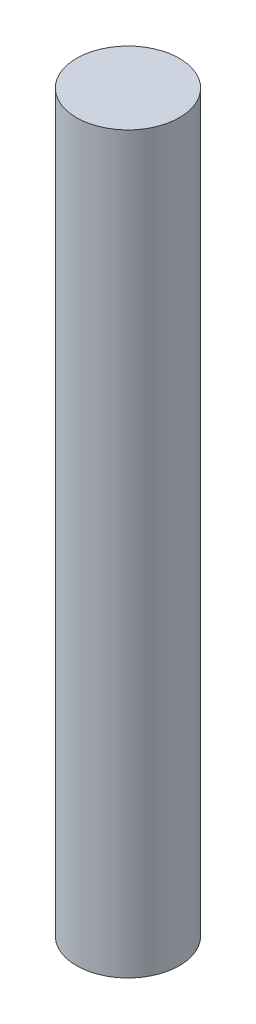
ISO-10303-21;
HEADER;
FILE_DESCRIPTION(('STEP AP214'),'2;1');
FILE_NAME('part.step','',(''),(''),'','','');
FILE_SCHEMA(('AUTOMOTIVE_DESIGN { 1 0 10303 214 1 1 1 1 }'));
ENDSEC;
DATA;
#1=APPLICATION_CONTEXT('core data for automotive mechanical design processes');
#2=APPLICATION_PROTOCOL_DEFINITION('international standard','automotive_design',2000,#1);
#3=PRODUCT_CONTEXT('',#1,'mechanical');
#4=PRODUCT('Part','Part','',(#3));
#5=PRODUCT_RELATED_PRODUCT_CATEGORY('part','',(#4));
#6=PRODUCT_DEFINITION_FORMATION('','',#4);
#7=PRODUCT_DEFINITION_CONTEXT('part definition',#1,'design');
#8=PRODUCT_DEFINITION('design','',#6,#7);
#9=PRODUCT_DEFINITION_SHAPE('','',#8);
#10=(LENGTH_UNIT() NAMED_UNIT(*) SI_UNIT(.MILLI.,.METRE.));
#11=(NAMED_UNIT(*) PLANE_ANGLE_UNIT() SI_UNIT($,.RADIAN.));
#12=(NAMED_UNIT(*) SI_UNIT($,.STERADIAN.) SOLID_ANGLE_UNIT());
#13=UNCERTAINTY_MEASURE_WITH_UNIT(LENGTH_MEASURE(1.E-05),#10,'distance_accuracy_value','');
#14=(GEOMETRIC_REPRESENTATION_CONTEXT(3) GLOBAL_UNCERTAINTY_ASSIGNED_CONTEXT((#13)) GLOBAL_UNIT_ASSIGNED_CONTEXT((#10,
#11,#12)) REPRESENTATION_CONTEXT('',''));
#15=CARTESIAN_POINT('',(0.,0.,0.));
#16=DIRECTION('',(0.,0.,1.));
#17=DIRECTION('',(1.,0.,0.));
#18=AXIS2_PLACEMENT_3D('',#15,#16,#17);
#19=CARTESIAN_POINT('',(-56.8401819382914,50.,-24.1080771669305));
#20=DIRECTION('',(0.,-1.,0.));
#21=DIRECTION('',(0.,0.,-1.));
#22=AXIS2_PLACEMENT_3D('',#19,#20,#21);
#23=CYLINDRICAL_SURFACE('',#22,3.5);
#24=CARTESIAN_POINT('',(-56.8401819382914,50.,-24.1080771669305));
#25=DIRECTION('',(0.,1.,0.));
#26=DIRECTION('',(0.,0.,1.));
#27=AXIS2_PLACEMENT_3D('',#24,#25,#26);
#28=CIRCLE('',#27,3.5);
#29=CARTESIAN_POINT('',(-56.8401819382914,50.,-20.6080771669305));
#30=VERTEX_POINT('',#29);
#31=EDGE_CURVE('E10',#30,#30,#28,.T.);
#32=ORIENTED_EDGE('',*,*,#31,.F.);
#33=EDGE_LOOP('',(#32));
#34=FACE_BOUND('',#33,.T.);
#35=CARTESIAN_POINT('',(-56.8401819382914,0.,-24.1080771669305));
#36=DIRECTION('',(0.,1.,0.));
#37=DIRECTION('',(0.,0.,1.));
#38=AXIS2_PLACEMENT_3D('',#35,#36,#37);
#39=CIRCLE('',#38,3.5);
#40=CARTESIAN_POINT('',(-56.8401819382914,0.,-20.6080771669305));
#41=VERTEX_POINT('',#40);
#42=EDGE_CURVE('E32',#41,#41,#39,.T.);
#43=ORIENTED_EDGE('',*,*,#42,.T.);
#44=EDGE_LOOP('',(#43));
#45=FACE_BOUND('',#44,.T.);
#46=ADVANCED_FACE('F29',(#34,#45),#23,.T.);
#47=CARTESIAN_POINT('',(-56.8401819382914,50.,-24.1080771669305));
#48=DIRECTION('',(0.,1.,0.));
#49=DIRECTION('',(0.,0.,1.));
#50=AXIS2_PLACEMENT_3D('',#47,#48,#49);
#51=PLANE('',#50);
#52=ORIENTED_EDGE('',*,*,#31,.T.);
#53=EDGE_LOOP('',(#52));
#54=FACE_BOUND('',#53,.T.);
#55=ADVANCED_FACE('F44',(#54),#51,.T.);
#56=CARTESIAN_POINT('',(-56.8401819382914,0.,-24.1080771669305));
#57=DIRECTION('',(0.,1.,0.));
#58=DIRECTION('',(0.,0.,1.));
#59=AXIS2_PLACEMENT_3D('',#56,#57,#58);
#60=PLANE('',#59);
#61=ORIENTED_EDGE('',*,*,#42,.F.);
#62=EDGE_LOOP('',(#61));
#63=FACE_BOUND('',#62,.T.);
#64=ADVANCED_FACE('F42',(#63),#60,.F.);
#65=CLOSED_SHELL('',(#46,#55,#64));
#66=MANIFOLD_SOLID_BREP('B2',#65);
#67=ADVANCED_BREP_SHAPE_REPRESENTATION('',(#18,#66),#14);
#68=SHAPE_DEFINITION_REPRESENTATION(#9,#67);
ENDSEC;
END-ISO-10303-21;
